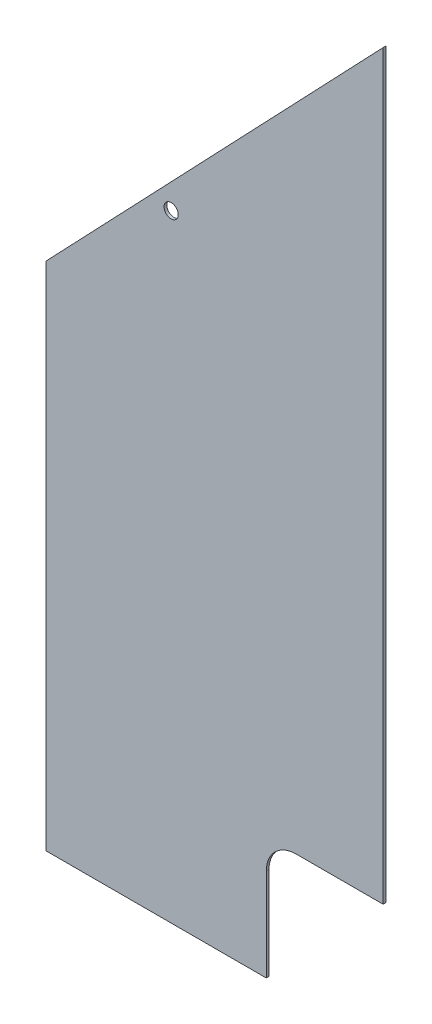
ISO-10303-21;
HEADER;
FILE_DESCRIPTION(('STEP AP214'),'2;1');
FILE_NAME('part.step','',(''),(''),'','','');
FILE_SCHEMA(('AUTOMOTIVE_DESIGN { 1 0 10303 214 1 1 1 1 }'));
ENDSEC;
DATA;
#1=APPLICATION_CONTEXT('core data for automotive mechanical design processes');
#2=APPLICATION_PROTOCOL_DEFINITION('international standard','automotive_design',2000,#1);
#3=PRODUCT_CONTEXT('',#1,'mechanical');
#4=PRODUCT('Part','Part','',(#3));
#5=PRODUCT_RELATED_PRODUCT_CATEGORY('part','',(#4));
#6=PRODUCT_DEFINITION_FORMATION('','',#4);
#7=PRODUCT_DEFINITION_CONTEXT('part definition',#1,'design');
#8=PRODUCT_DEFINITION('design','',#6,#7);
#9=PRODUCT_DEFINITION_SHAPE('','',#8);
#10=(LENGTH_UNIT() NAMED_UNIT(*) SI_UNIT(.MILLI.,.METRE.));
#11=(NAMED_UNIT(*) PLANE_ANGLE_UNIT() SI_UNIT($,.RADIAN.));
#12=(NAMED_UNIT(*) SI_UNIT($,.STERADIAN.) SOLID_ANGLE_UNIT());
#13=UNCERTAINTY_MEASURE_WITH_UNIT(LENGTH_MEASURE(1.E-05),#10,'distance_accuracy_value','');
#14=(GEOMETRIC_REPRESENTATION_CONTEXT(3) GLOBAL_UNCERTAINTY_ASSIGNED_CONTEXT((#13)) GLOBAL_UNIT_ASSIGNED_CONTEXT((#10,
#11,#12)) REPRESENTATION_CONTEXT('',''));
#15=CARTESIAN_POINT('',(0.,0.,0.));
#16=DIRECTION('',(0.,0.,1.));
#17=DIRECTION('',(1.,0.,0.));
#18=AXIS2_PLACEMENT_3D('',#15,#16,#17);
#19=CARTESIAN_POINT('',(-393.7,0.,3.175));
#20=DIRECTION('',(1.,0.,0.));
#21=DIRECTION('',(0.,0.,-1.));
#22=AXIS2_PLACEMENT_3D('',#19,#20,#21);
#23=PLANE('',#22);
#24=DIRECTION('',(0.,-1.,0.));
#25=VECTOR('',#24,1.);
#26=CARTESIAN_POINT('',(-393.7,0.,0.));
#27=LINE('',#26,#25);
#28=CARTESIAN_POINT('',(-393.7,596.9,0.));
#29=VERTEX_POINT('',#28);
#30=CARTESIAN_POINT('',(-393.7,0.,0.));
#31=VERTEX_POINT('',#30);
#32=EDGE_CURVE('E126',#29,#31,#27,.T.);
#33=ORIENTED_EDGE('',*,*,#32,.T.);
#34=DIRECTION('',(0.,0.,-1.));
#35=VECTOR('',#34,1.);
#36=CARTESIAN_POINT('',(-393.7,0.,3.175));
#37=LINE('',#36,#35);
#38=CARTESIAN_POINT('',(-393.7,0.,3.175));
#39=VERTEX_POINT('',#38);
#40=EDGE_CURVE('E11',#39,#31,#37,.T.);
#41=ORIENTED_EDGE('',*,*,#40,.F.);
#42=DIRECTION('',(0.,-1.,0.));
#43=VECTOR('',#42,1.);
#44=CARTESIAN_POINT('',(-393.7,0.,3.175));
#45=LINE('',#44,#43);
#46=CARTESIAN_POINT('',(-393.7,596.9,3.175));
#47=VERTEX_POINT('',#46);
#48=EDGE_CURVE('E123',#47,#39,#45,.T.);
#49=ORIENTED_EDGE('',*,*,#48,.F.);
#50=DIRECTION('',(0.,0.,-1.));
#51=VECTOR('',#50,1.);
#52=CARTESIAN_POINT('',(-393.7,596.9,3.175));
#53=LINE('',#52,#51);
#54=EDGE_CURVE('E130',#47,#29,#53,.T.);
#55=ORIENTED_EDGE('',*,*,#54,.T.);
#56=EDGE_LOOP('',(#33,#41,#49,#55));
#57=FACE_BOUND('',#56,.T.);
#58=ADVANCED_FACE('F33',(#57),#23,.F.);
#59=CARTESIAN_POINT('',(0.,0.,3.175));
#60=DIRECTION('',(0.,1.,0.));
#61=DIRECTION('',(-1.,0.,0.));
#62=AXIS2_PLACEMENT_3D('',#59,#60,#61);
#63=PLANE('',#62);
#64=DIRECTION('',(1.,0.,0.));
#65=VECTOR('',#64,1.);
#66=CARTESIAN_POINT('',(0.,0.,0.));
#67=LINE('',#66,#65);
#68=CARTESIAN_POINT('',(-136.525,0.,0.));
#69=VERTEX_POINT('',#68);
#70=EDGE_CURVE('E121',#31,#69,#67,.T.);
#71=ORIENTED_EDGE('',*,*,#70,.T.);
#72=DIRECTION('',(0.,0.,1.));
#73=VECTOR('',#72,1.);
#74=CARTESIAN_POINT('',(-136.525,0.,0.));
#75=LINE('',#74,#73);
#76=CARTESIAN_POINT('',(-136.525,0.,3.175));
#77=VERTEX_POINT('',#76);
#78=EDGE_CURVE('E146',#69,#77,#75,.T.);
#79=ORIENTED_EDGE('',*,*,#78,.T.);
#80=DIRECTION('',(1.,0.,0.));
#81=VECTOR('',#80,1.);
#82=CARTESIAN_POINT('',(0.,0.,3.175));
#83=LINE('',#82,#81);
#84=EDGE_CURVE('E79',#39,#77,#83,.T.);
#85=ORIENTED_EDGE('',*,*,#84,.F.);
#86=ORIENTED_EDGE('',*,*,#40,.T.);
#87=EDGE_LOOP('',(#71,#79,#85,#86));
#88=FACE_BOUND('',#87,.T.);
#89=ADVANCED_FACE('F154',(#88),#63,.F.);
#90=CARTESIAN_POINT('',(-1.23165366794353E-13,1009.65,3.175));
#91=DIRECTION('',(-1.,0.,0.));
#92=DIRECTION('',(0.,-1.,0.));
#93=AXIS2_PLACEMENT_3D('',#90,#91,#92);
#94=PLANE('',#93);
#95=DIRECTION('',(0.,1.,0.));
#96=VECTOR('',#95,1.);
#97=CARTESIAN_POINT('',(-1.23165366794353E-13,1009.65,3.175));
#98=LINE('',#97,#96);
#99=CARTESIAN_POINT('',(0.,142.875,3.175));
#100=VERTEX_POINT('',#99);
#101=CARTESIAN_POINT('',(-1.23165366794353E-13,1009.65,3.175));
#102=VERTEX_POINT('',#101);
#103=EDGE_CURVE('E116',#100,#102,#98,.T.);
#104=ORIENTED_EDGE('',*,*,#103,.F.);
#105=DIRECTION('',(0.,0.,1.));
#106=VECTOR('',#105,1.);
#107=CARTESIAN_POINT('',(0.,142.875,0.));
#108=LINE('',#107,#106);
#109=CARTESIAN_POINT('',(0.,142.875,0.));
#110=VERTEX_POINT('',#109);
#111=EDGE_CURVE('E104',#110,#100,#108,.T.);
#112=ORIENTED_EDGE('',*,*,#111,.F.);
#113=DIRECTION('',(0.,1.,0.));
#114=VECTOR('',#113,1.);
#115=CARTESIAN_POINT('',(-1.23165366794353E-13,1009.65,0.));
#116=LINE('',#115,#114);
#117=CARTESIAN_POINT('',(-1.23165366794353E-13,1009.65,0.));
#118=VERTEX_POINT('',#117);
#119=EDGE_CURVE('E115',#110,#118,#116,.T.);
#120=ORIENTED_EDGE('',*,*,#119,.T.);
#121=DIRECTION('',(0.,0.,-1.));
#122=VECTOR('',#121,1.);
#123=CARTESIAN_POINT('',(-1.23165366794353E-13,1009.65,3.175));
#124=LINE('',#123,#122);
#125=EDGE_CURVE('E40',#102,#118,#124,.T.);
#126=ORIENTED_EDGE('',*,*,#125,.F.);
#127=EDGE_LOOP('',(#104,#112,#120,#126));
#128=FACE_BOUND('',#127,.T.);
#129=ADVANCED_FACE('F113',(#128),#94,.F.);
#130=CARTESIAN_POINT('',(-393.7,596.9,3.175));
#131=DIRECTION('',(0.723608232033296,-0.690210929016375,0.));
#132=DIRECTION('',(0.690210929016375,0.723608232033296,0.));
#133=AXIS2_PLACEMENT_3D('',#130,#131,#132);
#134=PLANE('',#133);
#135=DIRECTION('',(-0.690210929016375,-0.723608232033296,0.));
#136=VECTOR('',#135,1.);
#137=CARTESIAN_POINT('',(-393.7,596.9,0.));
#138=LINE('',#137,#136);
#139=EDGE_CURVE('E73',#118,#29,#138,.T.);
#140=ORIENTED_EDGE('',*,*,#139,.T.);
#141=ORIENTED_EDGE('',*,*,#54,.F.);
#142=DIRECTION('',(-0.690210929016375,-0.723608232033296,0.));
#143=VECTOR('',#142,1.);
#144=CARTESIAN_POINT('',(-393.7,596.9,3.175));
#145=LINE('',#144,#143);
#146=EDGE_CURVE('E56',#102,#47,#145,.T.);
#147=ORIENTED_EDGE('',*,*,#146,.F.);
#148=ORIENTED_EDGE('',*,*,#125,.T.);
#149=EDGE_LOOP('',(#140,#141,#147,#148));
#150=FACE_BOUND('',#149,.T.);
#151=ADVANCED_FACE('F131',(#150),#134,.F.);
#152=CARTESIAN_POINT('',(0.,0.,3.175));
#153=DIRECTION('',(0.,0.,1.));
#154=DIRECTION('',(1.,0.,0.));
#155=AXIS2_PLACEMENT_3D('',#152,#153,#154);
#156=PLANE('',#155);
#157=DIRECTION('',(0.,-1.,0.));
#158=VECTOR('',#157,1.);
#159=CARTESIAN_POINT('',(-136.525,107.95,3.175));
#160=LINE('',#159,#158);
#161=CARTESIAN_POINT('',(-136.525,107.95,3.175));
#162=VERTEX_POINT('',#161);
#163=EDGE_CURVE('E109',#162,#77,#160,.T.);
#164=ORIENTED_EDGE('',*,*,#163,.F.);
#165=CARTESIAN_POINT('',(-101.6,107.95,3.175));
#166=DIRECTION('',(0.,0.,1.));
#167=DIRECTION('',(1.,0.,0.));
#168=AXIS2_PLACEMENT_3D('',#165,#166,#167);
#169=CIRCLE('',#168,34.925);
#170=CARTESIAN_POINT('',(-101.6,142.875,3.175));
#171=VERTEX_POINT('',#170);
#172=EDGE_CURVE('E163',#171,#162,#169,.T.);
#173=ORIENTED_EDGE('',*,*,#172,.F.);
#174=DIRECTION('',(-1.,0.,0.));
#175=VECTOR('',#174,1.);
#176=CARTESIAN_POINT('',(0.,142.875,3.175));
#177=LINE('',#176,#175);
#178=EDGE_CURVE('E161',#100,#171,#177,.T.);
#179=ORIENTED_EDGE('',*,*,#178,.F.);
#180=ORIENTED_EDGE('',*,*,#103,.T.);
#181=ORIENTED_EDGE('',*,*,#146,.T.);
#182=ORIENTED_EDGE('',*,*,#48,.T.);
#183=ORIENTED_EDGE('',*,*,#84,.T.);
#184=EDGE_LOOP('',(#164,#173,#179,#180,#181,#182,#183));
#185=FACE_BOUND('',#184,.T.);
#186=CARTESIAN_POINT('',(-247.650000000001,720.725,3.175));
#187=DIRECTION('',(0.,0.,1.));
#188=DIRECTION('',(1.,0.,0.));
#189=AXIS2_PLACEMENT_3D('',#186,#187,#188);
#190=CIRCLE('',#189,8.25500000000002);
#191=CARTESIAN_POINT('',(-239.395000000001,720.725,3.175));
#192=VERTEX_POINT('',#191);
#193=EDGE_CURVE('E141',#192,#192,#190,.T.);
#194=ORIENTED_EDGE('',*,*,#193,.F.);
#195=EDGE_LOOP('',(#194));
#196=FACE_BOUND('',#195,.T.);
#197=ADVANCED_FACE('F151',(#185,#196),#156,.T.);
#198=CARTESIAN_POINT('',(0.,0.,0.));
#199=DIRECTION('',(0.,0.,1.));
#200=DIRECTION('',(1.,0.,0.));
#201=AXIS2_PLACEMENT_3D('',#198,#199,#200);
#202=PLANE('',#201);
#203=CARTESIAN_POINT('',(-247.650000000001,720.725,0.));
#204=DIRECTION('',(0.,0.,1.));
#205=DIRECTION('',(1.,0.,0.));
#206=AXIS2_PLACEMENT_3D('',#203,#204,#205);
#207=CIRCLE('',#206,8.25500000000002);
#208=CARTESIAN_POINT('',(-239.395000000001,720.725,0.));
#209=VERTEX_POINT('',#208);
#210=EDGE_CURVE('E137',#209,#209,#207,.T.);
#211=ORIENTED_EDGE('',*,*,#210,.T.);
#212=EDGE_LOOP('',(#211));
#213=FACE_BOUND('',#212,.T.);
#214=CARTESIAN_POINT('',(-101.6,107.95,0.));
#215=DIRECTION('',(0.,0.,1.));
#216=DIRECTION('',(1.,0.,0.));
#217=AXIS2_PLACEMENT_3D('',#214,#215,#216);
#218=CIRCLE('',#217,34.925);
#219=CARTESIAN_POINT('',(-101.6,142.875,0.));
#220=VERTEX_POINT('',#219);
#221=CARTESIAN_POINT('',(-136.525,107.95,0.));
#222=VERTEX_POINT('',#221);
#223=EDGE_CURVE('E47',#220,#222,#218,.T.);
#224=ORIENTED_EDGE('',*,*,#223,.T.);
#225=DIRECTION('',(0.,-1.,0.));
#226=VECTOR('',#225,1.);
#227=CARTESIAN_POINT('',(-136.525,107.95,0.));
#228=LINE('',#227,#226);
#229=EDGE_CURVE('E117',#222,#69,#228,.T.);
#230=ORIENTED_EDGE('',*,*,#229,.T.);
#231=ORIENTED_EDGE('',*,*,#70,.F.);
#232=ORIENTED_EDGE('',*,*,#32,.F.);
#233=ORIENTED_EDGE('',*,*,#139,.F.);
#234=ORIENTED_EDGE('',*,*,#119,.F.);
#235=DIRECTION('',(-1.,0.,0.));
#236=VECTOR('',#235,1.);
#237=CARTESIAN_POINT('',(0.,142.875,0.));
#238=LINE('',#237,#236);
#239=EDGE_CURVE('E100',#110,#220,#238,.T.);
#240=ORIENTED_EDGE('',*,*,#239,.T.);
#241=EDGE_LOOP('',(#224,#230,#231,#232,#233,#234,#240));
#242=FACE_BOUND('',#241,.T.);
#243=ADVANCED_FACE('F119',(#213,#242),#202,.F.);
#244=CARTESIAN_POINT('',(-247.650000000001,720.725,0.));
#245=DIRECTION('',(0.,0.,1.));
#246=DIRECTION('',(1.,0.,0.));
#247=AXIS2_PLACEMENT_3D('',#244,#245,#246);
#248=CYLINDRICAL_SURFACE('',#247,8.25500000000002);
#249=ORIENTED_EDGE('',*,*,#210,.F.);
#250=EDGE_LOOP('',(#249));
#251=FACE_BOUND('',#250,.T.);
#252=ORIENTED_EDGE('',*,*,#193,.T.);
#253=EDGE_LOOP('',(#252));
#254=FACE_BOUND('',#253,.T.);
#255=ADVANCED_FACE('F172',(#251,#254),#248,.F.);
#256=CARTESIAN_POINT('',(-136.525,107.95,0.));
#257=DIRECTION('',(-1.,0.,0.));
#258=DIRECTION('',(0.,-1.,0.));
#259=AXIS2_PLACEMENT_3D('',#256,#257,#258);
#260=PLANE('',#259);
#261=ORIENTED_EDGE('',*,*,#163,.T.);
#262=ORIENTED_EDGE('',*,*,#78,.F.);
#263=ORIENTED_EDGE('',*,*,#229,.F.);
#264=DIRECTION('',(0.,0.,1.));
#265=VECTOR('',#264,1.);
#266=CARTESIAN_POINT('',(-136.525,107.95,0.));
#267=LINE('',#266,#265);
#268=EDGE_CURVE('E168',#222,#162,#267,.T.);
#269=ORIENTED_EDGE('',*,*,#268,.T.);
#270=EDGE_LOOP('',(#261,#262,#263,#269));
#271=FACE_BOUND('',#270,.T.);
#272=ADVANCED_FACE('F170',(#271),#260,.F.);
#273=CARTESIAN_POINT('',(-101.6,107.95,0.));
#274=DIRECTION('',(0.,0.,1.));
#275=DIRECTION('',(1.,0.,0.));
#276=AXIS2_PLACEMENT_3D('',#273,#274,#275);
#277=CYLINDRICAL_SURFACE('',#276,34.925);
#278=ORIENTED_EDGE('',*,*,#172,.T.);
#279=ORIENTED_EDGE('',*,*,#268,.F.);
#280=ORIENTED_EDGE('',*,*,#223,.F.);
#281=DIRECTION('',(0.,0.,1.));
#282=VECTOR('',#281,1.);
#283=CARTESIAN_POINT('',(-101.6,142.875,0.));
#284=LINE('',#283,#282);
#285=EDGE_CURVE('E106',#220,#171,#284,.T.);
#286=ORIENTED_EDGE('',*,*,#285,.T.);
#287=EDGE_LOOP('',(#278,#279,#280,#286));
#288=FACE_BOUND('',#287,.T.);
#289=ADVANCED_FACE('F169',(#288),#277,.F.);
#290=CARTESIAN_POINT('',(0.,142.875,0.));
#291=DIRECTION('',(0.,1.,0.));
#292=DIRECTION('',(-1.,0.,0.));
#293=AXIS2_PLACEMENT_3D('',#290,#291,#292);
#294=PLANE('',#293);
#295=ORIENTED_EDGE('',*,*,#178,.T.);
#296=ORIENTED_EDGE('',*,*,#285,.F.);
#297=ORIENTED_EDGE('',*,*,#239,.F.);
#298=ORIENTED_EDGE('',*,*,#111,.T.);
#299=EDGE_LOOP('',(#295,#296,#297,#298));
#300=FACE_BOUND('',#299,.T.);
#301=ADVANCED_FACE('F103',(#300),#294,.F.);
#302=CLOSED_SHELL('',(#58,#89,#129,#151,#197,#243,#255,#272,#289,#301));
#303=MANIFOLD_SOLID_BREP('B2',#302);
#304=ADVANCED_BREP_SHAPE_REPRESENTATION('',(#18,#303),#14);
#305=SHAPE_DEFINITION_REPRESENTATION(#9,#304);
ENDSEC;
END-ISO-10303-21;
